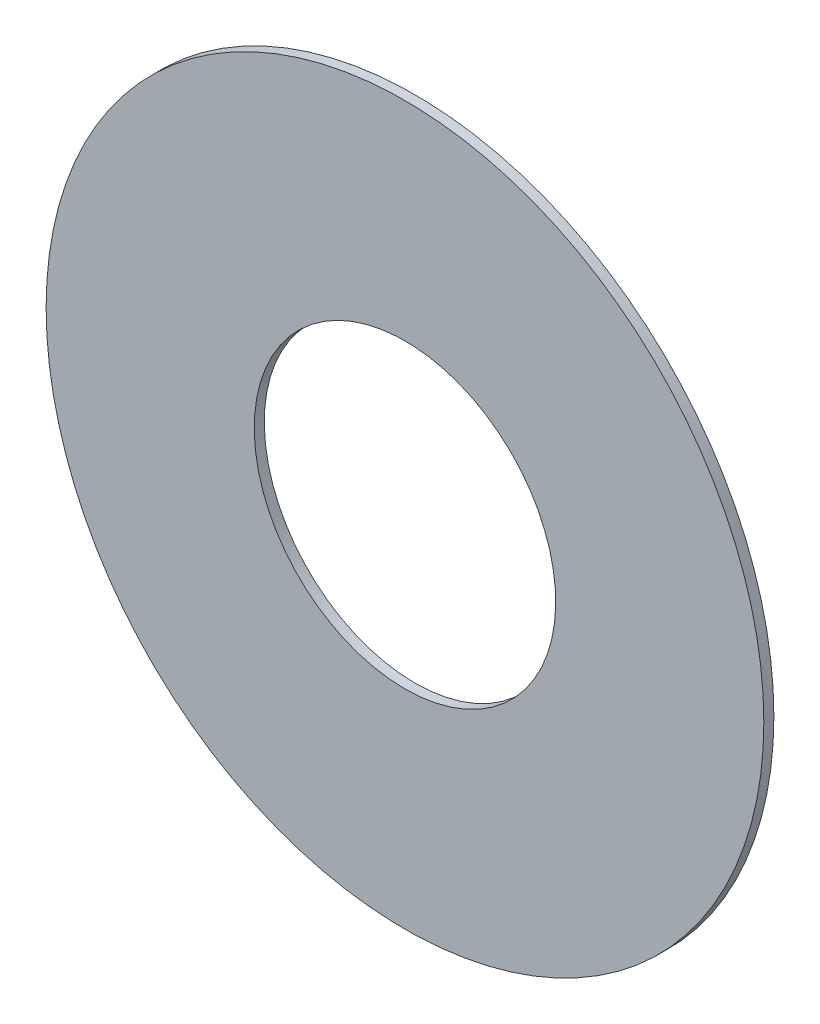
ISO-10303-21;
HEADER;
FILE_DESCRIPTION(('STEP AP214'),'2;1');
FILE_NAME('part.step','',(''),(''),'','','');
FILE_SCHEMA(('AUTOMOTIVE_DESIGN { 1 0 10303 214 1 1 1 1 }'));
ENDSEC;
DATA;
#1=APPLICATION_CONTEXT('core data for automotive mechanical design processes');
#2=APPLICATION_PROTOCOL_DEFINITION('international standard','automotive_design',2000,#1);
#3=PRODUCT_CONTEXT('',#1,'mechanical');
#4=PRODUCT('Part','Part','',(#3));
#5=PRODUCT_RELATED_PRODUCT_CATEGORY('part','',(#4));
#6=PRODUCT_DEFINITION_FORMATION('','',#4);
#7=PRODUCT_DEFINITION_CONTEXT('part definition',#1,'design');
#8=PRODUCT_DEFINITION('design','',#6,#7);
#9=PRODUCT_DEFINITION_SHAPE('','',#8);
#10=(LENGTH_UNIT() NAMED_UNIT(*) SI_UNIT(.MILLI.,.METRE.));
#11=(NAMED_UNIT(*) PLANE_ANGLE_UNIT() SI_UNIT($,.RADIAN.));
#12=(NAMED_UNIT(*) SI_UNIT($,.STERADIAN.) SOLID_ANGLE_UNIT());
#13=UNCERTAINTY_MEASURE_WITH_UNIT(LENGTH_MEASURE(1.E-05),#10,'distance_accuracy_value','');
#14=(GEOMETRIC_REPRESENTATION_CONTEXT(3) GLOBAL_UNCERTAINTY_ASSIGNED_CONTEXT((#13)) GLOBAL_UNIT_ASSIGNED_CONTEXT((#10,
#11,#12)) REPRESENTATION_CONTEXT('',''));
#15=CARTESIAN_POINT('',(0.,0.,0.));
#16=DIRECTION('',(0.,0.,1.));
#17=DIRECTION('',(1.,0.,0.));
#18=AXIS2_PLACEMENT_3D('',#15,#16,#17);
#19=CARTESIAN_POINT('',(154.002,-113.984,-0.045));
#20=DIRECTION('',(0.,0.,-1.));
#21=DIRECTION('',(0.,-1.,0.));
#22=AXIS2_PLACEMENT_3D('',#19,#20,#21);
#23=CYLINDRICAL_SURFACE('',#22,0.525);
#24=CARTESIAN_POINT('',(154.002,-113.984,-0.035));
#25=DIRECTION('',(0.,0.,-1.));
#26=DIRECTION('',(0.,-1.,0.));
#27=AXIS2_PLACEMENT_3D('',#24,#25,#26);
#28=CIRCLE('',#27,0.525);
#29=CARTESIAN_POINT('',(154.002,-114.509,-0.035));
#30=VERTEX_POINT('',#29);
#31=EDGE_CURVE('E26',#30,#30,#28,.T.);
#32=ORIENTED_EDGE('',*,*,#31,.T.);
#33=DIRECTION('',(0.,0.,1.));
#34=VECTOR('',#33,1.);
#35=CARTESIAN_POINT('',(154.002,-114.509,-0.045));
#36=LINE('',#35,#34);
#37=CARTESIAN_POINT('',(154.002,-114.509,0.));
#38=VERTEX_POINT('',#37);
#39=EDGE_CURVE('E11',#30,#38,#36,.T.);
#40=ORIENTED_EDGE('',*,*,#39,.T.);
#41=CARTESIAN_POINT('',(154.002,-113.984,0.));
#42=DIRECTION('',(0.,0.,-1.));
#43=DIRECTION('',(0.,-1.,0.));
#44=AXIS2_PLACEMENT_3D('',#41,#42,#43);
#45=CIRCLE('',#44,0.525);
#46=EDGE_CURVE('E20',#38,#38,#45,.T.);
#47=ORIENTED_EDGE('',*,*,#46,.F.);
#48=ORIENTED_EDGE('',*,*,#39,.F.);
#49=EDGE_LOOP('',(#32,#40,#47,#48));
#50=FACE_BOUND('',#49,.T.);
#51=ADVANCED_FACE('F17',(#50),#23,.F.);
#52=CARTESIAN_POINT('',(154.002,-113.984,-0.035));
#53=DIRECTION('',(0.,0.,1.));
#54=DIRECTION('',(1.,0.,0.));
#55=AXIS2_PLACEMENT_3D('',#52,#53,#54);
#56=PLANE('',#55);
#57=ORIENTED_EDGE('',*,*,#31,.F.);
#58=EDGE_LOOP('',(#57));
#59=FACE_BOUND('',#58,.T.);
#60=CARTESIAN_POINT('',(154.002,-113.984,-0.035));
#61=DIRECTION('',(0.,0.,1.));
#62=DIRECTION('',(1.,0.,0.));
#63=AXIS2_PLACEMENT_3D('',#60,#61,#62);
#64=CIRCLE('',#63,1.25);
#65=CARTESIAN_POINT('',(155.252,-113.984,-0.035));
#66=VERTEX_POINT('',#65);
#67=EDGE_CURVE('E58',#66,#66,#64,.T.);
#68=ORIENTED_EDGE('',*,*,#67,.F.);
#69=EDGE_LOOP('',(#68));
#70=FACE_BOUND('',#69,.T.);
#71=ADVANCED_FACE('F79',(#59,#70),#56,.F.);
#72=CARTESIAN_POINT('',(154.002,-113.984,0.));
#73=DIRECTION('',(0.,0.,1.));
#74=DIRECTION('',(1.,0.,0.));
#75=AXIS2_PLACEMENT_3D('',#72,#73,#74);
#76=PLANE('',#75);
#77=ORIENTED_EDGE('',*,*,#46,.T.);
#78=EDGE_LOOP('',(#77));
#79=FACE_BOUND('',#78,.T.);
#80=CARTESIAN_POINT('',(154.002,-113.984,0.));
#81=DIRECTION('',(0.,0.,1.));
#82=DIRECTION('',(1.,0.,0.));
#83=AXIS2_PLACEMENT_3D('',#80,#81,#82);
#84=CIRCLE('',#83,1.25);
#85=CARTESIAN_POINT('',(155.252,-113.984,0.));
#86=VERTEX_POINT('',#85);
#87=EDGE_CURVE('E56',#86,#86,#84,.T.);
#88=ORIENTED_EDGE('',*,*,#87,.T.);
#89=EDGE_LOOP('',(#88));
#90=FACE_BOUND('',#89,.T.);
#91=ADVANCED_FACE('F62',(#79,#90),#76,.T.);
#92=CARTESIAN_POINT('',(154.002,-113.984,-0.035));
#93=DIRECTION('',(0.,0.,1.));
#94=DIRECTION('',(1.,0.,0.));
#95=AXIS2_PLACEMENT_3D('',#92,#93,#94);
#96=CYLINDRICAL_SURFACE('',#95,1.25);
#97=ORIENTED_EDGE('',*,*,#87,.F.);
#98=DIRECTION('',(0.,0.,1.));
#99=VECTOR('',#98,1.);
#100=CARTESIAN_POINT('',(155.252,-113.984,-0.035));
#101=LINE('',#100,#99);
#102=EDGE_CURVE('E53',#66,#86,#101,.T.);
#103=ORIENTED_EDGE('',*,*,#102,.F.);
#104=ORIENTED_EDGE('',*,*,#67,.T.);
#105=ORIENTED_EDGE('',*,*,#102,.T.);
#106=EDGE_LOOP('',(#97,#103,#104,#105));
#107=FACE_BOUND('',#106,.T.);
#108=ADVANCED_FACE('F55',(#107),#96,.T.);
#109=CLOSED_SHELL('',(#51,#71,#91,#108));
#110=MANIFOLD_SOLID_BREP('B1',#109);
#111=ADVANCED_BREP_SHAPE_REPRESENTATION('',(#18,#110),#14);
#112=SHAPE_DEFINITION_REPRESENTATION(#9,#111);
ENDSEC;
END-ISO-10303-21;
